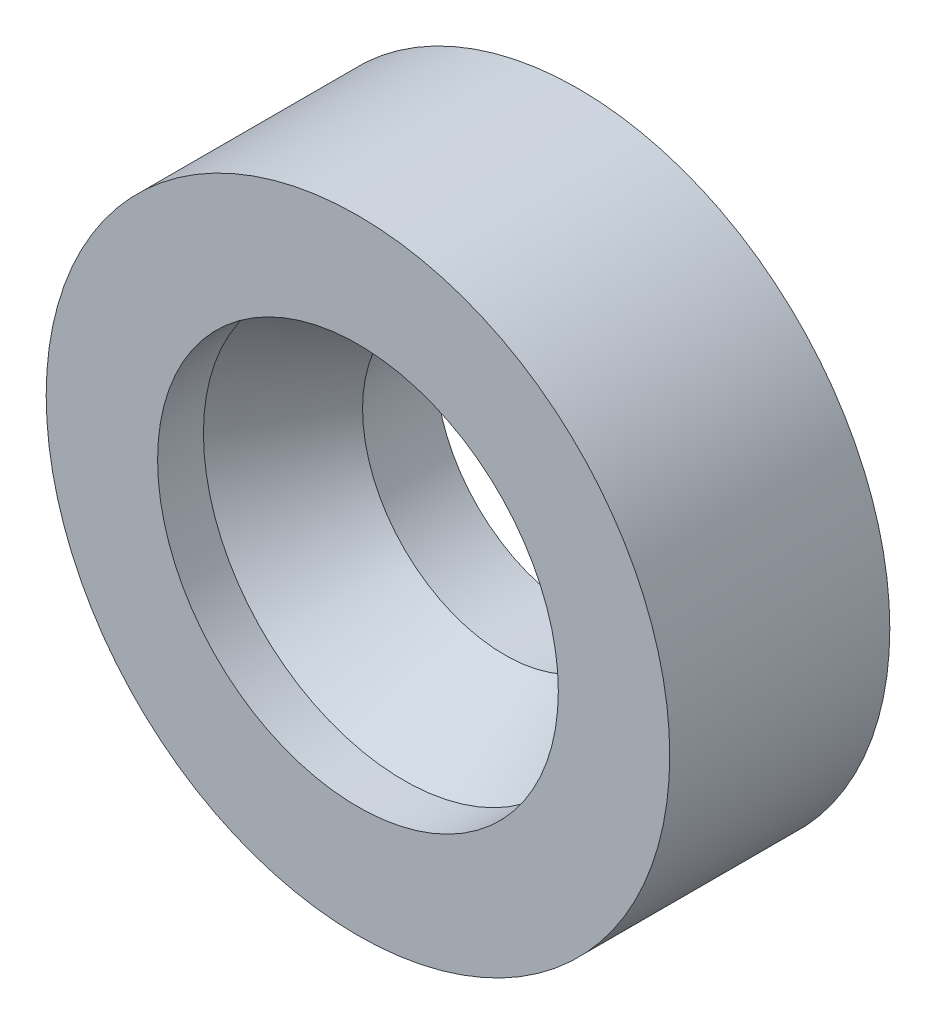
ISO-10303-21;
HEADER;
FILE_DESCRIPTION(('STEP AP214'),'2;1');
FILE_NAME('part.step','',(''),(''),'','','');
FILE_SCHEMA(('AUTOMOTIVE_DESIGN { 1 0 10303 214 1 1 1 1 }'));
ENDSEC;
DATA;
#1=APPLICATION_CONTEXT('core data for automotive mechanical design processes');
#2=APPLICATION_PROTOCOL_DEFINITION('international standard','automotive_design',2000,#1);
#3=PRODUCT_CONTEXT('',#1,'mechanical');
#4=PRODUCT('Part','Part','',(#3));
#5=PRODUCT_RELATED_PRODUCT_CATEGORY('part','',(#4));
#6=PRODUCT_DEFINITION_FORMATION('','',#4);
#7=PRODUCT_DEFINITION_CONTEXT('part definition',#1,'design');
#8=PRODUCT_DEFINITION('design','',#6,#7);
#9=PRODUCT_DEFINITION_SHAPE('','',#8);
#10=(LENGTH_UNIT() NAMED_UNIT(*) SI_UNIT(.MILLI.,.METRE.));
#11=(NAMED_UNIT(*) PLANE_ANGLE_UNIT() SI_UNIT($,.RADIAN.));
#12=(NAMED_UNIT(*) SI_UNIT($,.STERADIAN.) SOLID_ANGLE_UNIT());
#13=UNCERTAINTY_MEASURE_WITH_UNIT(LENGTH_MEASURE(1.E-05),#10,'distance_accuracy_value','');
#14=(GEOMETRIC_REPRESENTATION_CONTEXT(3) GLOBAL_UNCERTAINTY_ASSIGNED_CONTEXT((#13)) GLOBAL_UNIT_ASSIGNED_CONTEXT((#10,
#11,#12)) REPRESENTATION_CONTEXT('',''));
#15=CARTESIAN_POINT('',(0.,0.,0.));
#16=DIRECTION('',(0.,0.,1.));
#17=DIRECTION('',(1.,0.,0.));
#18=AXIS2_PLACEMENT_3D('',#15,#16,#17);
#19=CARTESIAN_POINT('',(0.,0.,2.4));
#20=DIRECTION('',(0.,0.,-1.));
#21=DIRECTION('',(-1.,0.,0.));
#22=AXIS2_PLACEMENT_3D('',#19,#20,#21);
#23=CYLINDRICAL_SURFACE('',#22,3.4);
#24=CARTESIAN_POINT('',(0.,0.,2.4));
#25=DIRECTION('',(0.,0.,1.));
#26=DIRECTION('',(1.,0.,0.));
#27=AXIS2_PLACEMENT_3D('',#24,#25,#26);
#28=CIRCLE('',#27,3.4);
#29=CARTESIAN_POINT('',(3.4,0.,2.4));
#30=VERTEX_POINT('',#29);
#31=EDGE_CURVE('E10',#30,#30,#28,.T.);
#32=ORIENTED_EDGE('',*,*,#31,.F.);
#33=EDGE_LOOP('',(#32));
#34=FACE_BOUND('',#33,.T.);
#35=CARTESIAN_POINT('',(0.,0.,0.));
#36=DIRECTION('',(0.,0.,1.));
#37=DIRECTION('',(1.,0.,0.));
#38=AXIS2_PLACEMENT_3D('',#35,#36,#37);
#39=CIRCLE('',#38,3.4);
#40=CARTESIAN_POINT('',(3.4,0.,0.));
#41=VERTEX_POINT('',#40);
#42=EDGE_CURVE('E40',#41,#41,#39,.T.);
#43=ORIENTED_EDGE('',*,*,#42,.T.);
#44=EDGE_LOOP('',(#43));
#45=FACE_BOUND('',#44,.T.);
#46=ADVANCED_FACE('F37',(#34,#45),#23,.T.);
#47=CARTESIAN_POINT('',(0.,0.,2.4));
#48=DIRECTION('',(0.,0.,1.));
#49=DIRECTION('',(1.,0.,0.));
#50=AXIS2_PLACEMENT_3D('',#47,#48,#49);
#51=PLANE('',#50);
#52=CARTESIAN_POINT('',(0.,0.,2.4));
#53=DIRECTION('',(0.,0.,1.));
#54=DIRECTION('',(1.,0.,0.));
#55=AXIS2_PLACEMENT_3D('',#52,#53,#54);
#56=CIRCLE('',#55,2.18508529610859);
#57=CARTESIAN_POINT('',(2.18508529610859,0.,2.4));
#58=VERTEX_POINT('',#57);
#59=EDGE_CURVE('E59',#58,#58,#56,.F.);
#60=ORIENTED_EDGE('',*,*,#59,.T.);
#61=EDGE_LOOP('',(#60));
#62=FACE_BOUND('',#61,.T.);
#63=ORIENTED_EDGE('',*,*,#31,.T.);
#64=EDGE_LOOP('',(#63));
#65=FACE_BOUND('',#64,.T.);
#66=ADVANCED_FACE('F84',(#62,#65),#51,.T.);
#67=CARTESIAN_POINT('',(0.,0.,0.));
#68=DIRECTION('',(0.,0.,1.));
#69=DIRECTION('',(1.,0.,0.));
#70=AXIS2_PLACEMENT_3D('',#67,#68,#69);
#71=PLANE('',#70);
#72=CARTESIAN_POINT('',(0.,0.,0.));
#73=DIRECTION('',(0.,0.,-1.));
#74=DIRECTION('',(-1.,0.,0.));
#75=AXIS2_PLACEMENT_3D('',#72,#73,#74);
#76=CIRCLE('',#75,1.55);
#77=CARTESIAN_POINT('',(-1.55,0.,0.));
#78=VERTEX_POINT('',#77);
#79=EDGE_CURVE('E49',#78,#78,#76,.T.);
#80=ORIENTED_EDGE('',*,*,#79,.F.);
#81=EDGE_LOOP('',(#80));
#82=FACE_BOUND('',#81,.T.);
#83=ORIENTED_EDGE('',*,*,#42,.F.);
#84=EDGE_LOOP('',(#83));
#85=FACE_BOUND('',#84,.T.);
#86=ADVANCED_FACE('F78',(#82,#85),#71,.F.);
#87=CARTESIAN_POINT('',(0.,0.,0.8));
#88=DIRECTION('',(0.,0.,-1.));
#89=DIRECTION('',(-1.,0.,0.));
#90=AXIS2_PLACEMENT_3D('',#87,#88,#89);
#91=CYLINDRICAL_SURFACE('',#90,1.55);
#92=CARTESIAN_POINT('',(0.,0.,0.8));
#93=DIRECTION('',(0.,0.,-1.));
#94=DIRECTION('',(-1.,0.,0.));
#95=AXIS2_PLACEMENT_3D('',#92,#93,#94);
#96=CIRCLE('',#95,1.55);
#97=CARTESIAN_POINT('',(-1.55,0.,0.8));
#98=VERTEX_POINT('',#97);
#99=EDGE_CURVE('E54',#98,#98,#96,.T.);
#100=ORIENTED_EDGE('',*,*,#99,.F.);
#101=EDGE_LOOP('',(#100));
#102=FACE_BOUND('',#101,.T.);
#103=ORIENTED_EDGE('',*,*,#79,.T.);
#104=EDGE_LOOP('',(#103));
#105=FACE_BOUND('',#104,.T.);
#106=ADVANCED_FACE('F72',(#102,#105),#91,.F.);
#107=CARTESIAN_POINT('',(0.,0.,0.8));
#108=DIRECTION('',(0.,0.,1.));
#109=DIRECTION('',(-1.,0.,0.));
#110=AXIS2_PLACEMENT_3D('',#107,#108,#109);
#111=CONICAL_SURFACE('',#110,1.55,0.5235987755983);
#112=CARTESIAN_POINT('',(0.,0.,1.9));
#113=DIRECTION('',(0.,0.,-1.));
#114=DIRECTION('',(-1.,0.,0.));
#115=AXIS2_PLACEMENT_3D('',#112,#113,#114);
#116=CIRCLE('',#115,2.18508529610859);
#117=CARTESIAN_POINT('',(-2.18508529610859,0.,1.9));
#118=VERTEX_POINT('',#117);
#119=EDGE_CURVE('E58',#118,#118,#116,.T.);
#120=ORIENTED_EDGE('',*,*,#119,.F.);
#121=EDGE_LOOP('',(#120));
#122=FACE_BOUND('',#121,.T.);
#123=ORIENTED_EDGE('',*,*,#99,.T.);
#124=EDGE_LOOP('',(#123));
#125=FACE_BOUND('',#124,.T.);
#126=ADVANCED_FACE('F69',(#122,#125),#111,.F.);
#127=CARTESIAN_POINT('',(0.,0.,2.401));
#128=DIRECTION('',(0.,0.,-1.));
#129=DIRECTION('',(-1.,0.,0.));
#130=AXIS2_PLACEMENT_3D('',#127,#128,#129);
#131=CYLINDRICAL_SURFACE('',#130,2.18508529610859);
#132=ORIENTED_EDGE('',*,*,#59,.F.);
#133=EDGE_LOOP('',(#132));
#134=FACE_BOUND('',#133,.T.);
#135=ORIENTED_EDGE('',*,*,#119,.T.);
#136=EDGE_LOOP('',(#135));
#137=FACE_BOUND('',#136,.T.);
#138=ADVANCED_FACE('F67',(#134,#137),#131,.F.);
#139=CLOSED_SHELL('',(#46,#66,#86,#106,#126,#138));
#140=MANIFOLD_SOLID_BREP('B2',#139);
#141=ADVANCED_BREP_SHAPE_REPRESENTATION('',(#18,#140),#14);
#142=SHAPE_DEFINITION_REPRESENTATION(#9,#141);
ENDSEC;
END-ISO-10303-21;
